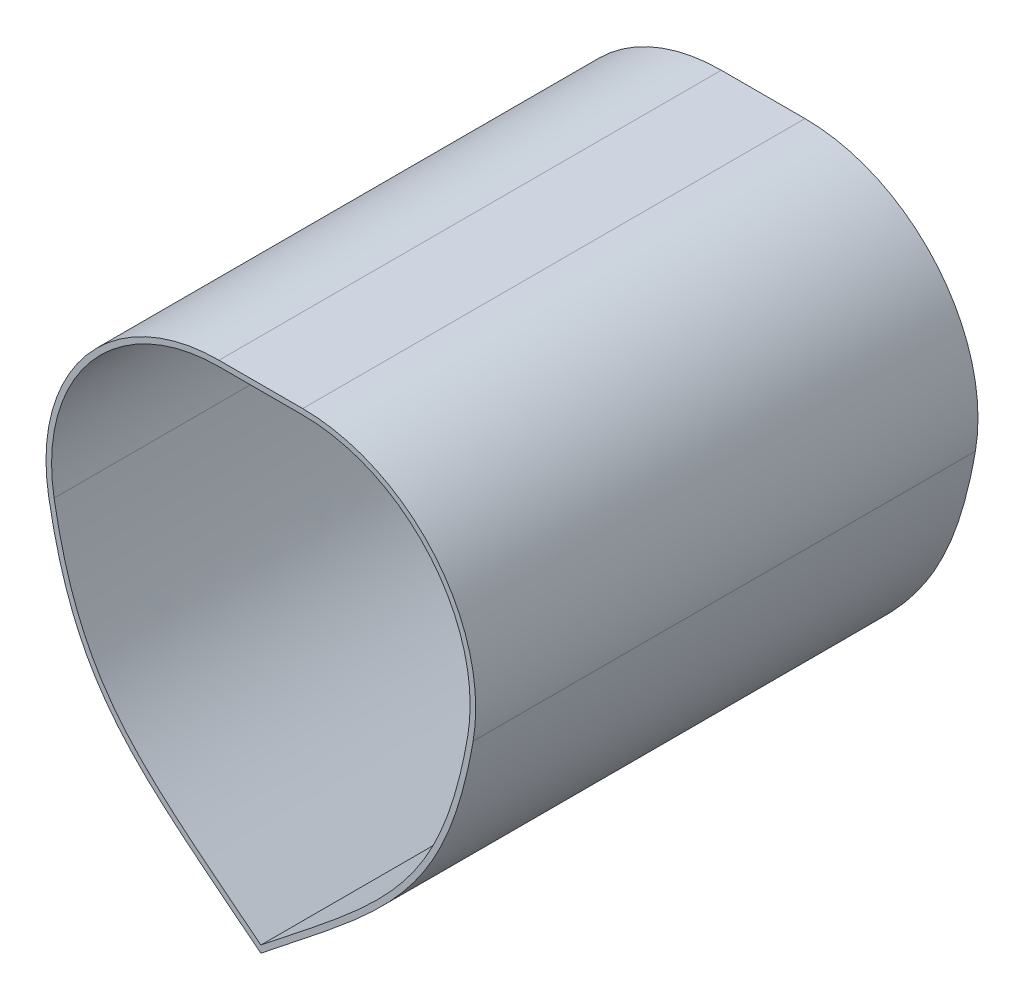
ISO-10303-21;
HEADER;
FILE_DESCRIPTION(('STEP AP214'),'2;1');
FILE_NAME('part.step','',(''),(''),'','','');
FILE_SCHEMA(('AUTOMOTIVE_DESIGN { 1 0 10303 214 1 1 1 1 }'));
ENDSEC;
DATA;
#1=APPLICATION_CONTEXT('core data for automotive mechanical design processes');
#2=APPLICATION_PROTOCOL_DEFINITION('international standard','automotive_design',2000,#1);
#3=PRODUCT_CONTEXT('',#1,'mechanical');
#4=PRODUCT('Part','Part','',(#3));
#5=PRODUCT_RELATED_PRODUCT_CATEGORY('part','',(#4));
#6=PRODUCT_DEFINITION_FORMATION('','',#4);
#7=PRODUCT_DEFINITION_CONTEXT('part definition',#1,'design');
#8=PRODUCT_DEFINITION('design','',#6,#7);
#9=PRODUCT_DEFINITION_SHAPE('','',#8);
#10=(LENGTH_UNIT() NAMED_UNIT(*) SI_UNIT(.MILLI.,.METRE.));
#11=(NAMED_UNIT(*) PLANE_ANGLE_UNIT() SI_UNIT($,.RADIAN.));
#12=(NAMED_UNIT(*) SI_UNIT($,.STERADIAN.) SOLID_ANGLE_UNIT());
#13=UNCERTAINTY_MEASURE_WITH_UNIT(LENGTH_MEASURE(1.E-05),#10,'distance_accuracy_value','');
#14=(GEOMETRIC_REPRESENTATION_CONTEXT(3) GLOBAL_UNCERTAINTY_ASSIGNED_CONTEXT((#13)) GLOBAL_UNIT_ASSIGNED_CONTEXT((#10,
#11,#12)) REPRESENTATION_CONTEXT('',''));
#15=CARTESIAN_POINT('',(0.,0.,0.));
#16=DIRECTION('',(0.,0.,1.));
#17=DIRECTION('',(1.,0.,0.));
#18=AXIS2_PLACEMENT_3D('',#15,#16,#17);
#19=CARTESIAN_POINT('',(7.50000000000002,-30.,90.));
#20=DIRECTION('',(0.,0.,-1.));
#21=DIRECTION('',(-1.,0.,0.));
#22=AXIS2_PLACEMENT_3D('',#19,#20,#21);
#23=PLANE('',#22);
#24=CARTESIAN_POINT('',(7.50000000000002,-30.,90.));
#25=DIRECTION('',(0.,0.,-1.));
#26=DIRECTION('',(-1.,0.,0.));
#27=AXIS2_PLACEMENT_3D('',#24,#25,#26);
#28=CIRCLE('',#27,31.00000000039);
#29=CARTESIAN_POINT('',(38.035382168266,-35.3470025141483,90.));
#30=VERTEX_POINT('',#29);
#31=CARTESIAN_POINT('',(7.50000000000001,1.,90.));
#32=VERTEX_POINT('',#31);
#33=EDGE_CURVE('E218',#30,#32,#28,.F.);
#34=ORIENTED_EDGE('',*,*,#33,.T.);
#35=DIRECTION('',(-1.,0.,0.));
#36=VECTOR('',#35,1.);
#37=CARTESIAN_POINT('',(7.50000000000001,1.,90.));
#38=LINE('',#37,#36);
#39=CARTESIAN_POINT('',(-7.49999999999999,1.,90.));
#40=VERTEX_POINT('',#39);
#41=EDGE_CURVE('E221',#32,#40,#38,.T.);
#42=ORIENTED_EDGE('',*,*,#41,.T.);
#43=CARTESIAN_POINT('',(-7.49999999999999,-30.,90.));
#44=DIRECTION('',(0.,0.,-1.));
#45=DIRECTION('',(-1.,0.,0.));
#46=AXIS2_PLACEMENT_3D('',#43,#44,#45);
#47=CIRCLE('',#46,31.0000000003738);
#48=CARTESIAN_POINT('',(-38.0353821678817,-35.3470025139877,90.));
#49=VERTEX_POINT('',#48);
#50=EDGE_CURVE('E224',#40,#49,#47,.F.);
#51=ORIENTED_EDGE('',*,*,#50,.T.);
#52=CARTESIAN_POINT('',(-38.0353821678817,-35.3470025139877,90.));
#53=CARTESIAN_POINT('',(-37.5548772752287,-38.091044711654,90.));
#54=CARTESIAN_POINT('',(-36.9822883935064,-40.8060836201717,90.));
#55=CARTESIAN_POINT('',(-35.5651587648619,-46.1505059539836,90.));
#56=CARTESIAN_POINT('',(-34.7201967506199,-48.7797566945623,90.));
#57=CARTESIAN_POINT('',(-33.1615785559713,-52.6319226413832,90.));
#58=CARTESIAN_POINT('',(-32.5933003750435,-53.9006269169014,90.));
#59=CARTESIAN_POINT('',(-31.6569648970911,-55.7772519816424,90.));
#60=CARTESIAN_POINT('',(-31.3302131469219,-56.39944948055,90.));
#61=CARTESIAN_POINT('',(-30.6546280964368,-57.6217528801752,90.));
#62=CARTESIAN_POINT('',(-30.3051339247036,-58.2232972999787,90.));
#63=CARTESIAN_POINT('',(-28.4997583725973,-61.1834785162522,90.));
#64=CARTESIAN_POINT('',(-26.8669707319669,-63.3968718224989,90.));
#65=CARTESIAN_POINT('',(-23.2936081412605,-67.570959050554,90.));
#66=CARTESIAN_POINT('',(-21.3552030997987,-69.5334345096587,90.));
#67=CARTESIAN_POINT('',(-18.3086312835862,-72.3630553352713,90.));
#68=CARTESIAN_POINT('',(-17.2691069456343,-73.2881893224012,90.));
#69=CARTESIAN_POINT('',(-15.1662054039002,-75.10550142771,90.));
#70=CARTESIAN_POINT('',(-14.1020486867199,-75.9985099712125,90.));
#71=CARTESIAN_POINT('',(-10.8861762356016,-78.6487154188085,90.));
#72=CARTESIAN_POINT('',(-8.71200864899408,-80.3782626255507,90.));
#73=CARTESIAN_POINT('',(-5.44481379026631,-82.9652639777595,90.));
#74=CARTESIAN_POINT('',(-4.35450638530162,-83.8260676687979,90.));
#75=CARTESIAN_POINT('',(-2.17547448835848,-85.5496244251936,90.));
#76=CARTESIAN_POINT('',(-1.0873039703784,-86.413059715471,90.));
#77=CARTESIAN_POINT('',(3.15560294908424E-11,-87.2775621683745,90.));
#78=B_SPLINE_CURVE_WITH_KNOTS('',3,(#52,#53,#54,#55,#56,#57,#58,#59,#60,#61,#62,#63,#64,#65,#66,
#67,#68,#69,#70,#71,#72,#73,#74,#75,#76,#77),.UNSPECIFIED.,.F.,.F.,(4,2,2,2,2,2,2,2,2,2,2,2,4),
(0.,0.124999999999999,0.249999999999998,0.312499999999998,0.343749999999998,0.374999999999998,
0.499999999999998,0.624999999999998,0.687499999999998,0.749999999999999,0.874999999999999,
0.9375,1.),.UNSPECIFIED.);
#79=CARTESIAN_POINT('',(3.15560294908424E-11,-87.2775621683745,90.));
#80=VERTEX_POINT('',#79);
#81=EDGE_CURVE('E226',#49,#80,#78,.T.);
#82=ORIENTED_EDGE('',*,*,#81,.T.);
#83=CARTESIAN_POINT('',(3.15560294908424E-11,-87.2775621683745,90.));
#84=CARTESIAN_POINT('',(1.08825791955665,-86.4123012417895,90.));
#85=CARTESIAN_POINT('',(2.17738223048351,-85.5481128518911,90.));
#86=CARTESIAN_POINT('',(4.35831445155176,-83.8230581948711,90.));
#87=CARTESIAN_POINT('',(5.4495695085125,-82.9615075311625,90.));
#88=CARTESIAN_POINT('',(8.71960050233189,-80.3722328696294,90.));
#89=CARTESIAN_POINT('',(10.8956515546259,-78.6411356404269,90.));
#90=CARTESIAN_POINT('',(15.1872123098211,-75.1039948954555,90.));
#91=CARTESIAN_POINT('',(17.30707074459,-73.2939756822945,90.));
#92=CARTESIAN_POINT('',(21.3670549034604,-69.5217398880481,90.));
#93=CARTESIAN_POINT('',(23.306811773598,-67.5574481489507,90.));
#94=CARTESIAN_POINT('',(26.8879810373477,-63.3703986668161,90.));
#95=CARTESIAN_POINT('',(28.5271989207947,-61.1457397447137,90.));
#96=CARTESIAN_POINT('',(30.3415709452379,-58.1616305015838,90.));
#97=CARTESIAN_POINT('',(30.6938032169842,-57.5530990711434,90.));
#98=CARTESIAN_POINT('',(31.3685903924633,-56.3275207608773,90.));
#99=CARTESIAN_POINT('',(31.6915813409841,-55.7099493342935,90.));
#100=CARTESIAN_POINT('',(32.6195100620392,-53.84360670894,90.));
#101=CARTESIAN_POINT('',(33.1833569685782,-52.5811916444626,90.));
#102=CARTESIAN_POINT('',(34.731190274976,-48.7462296507229,90.));
#103=CARTESIAN_POINT('',(35.5722237295399,-46.1262164356844,90.));
#104=CARTESIAN_POINT('',(36.9841990313474,-40.7965084296707,90.));
#105=CARTESIAN_POINT('',(37.5555919456647,-38.0869634116056,90.));
#106=CARTESIAN_POINT('',(38.035382168266,-35.3470025141483,90.));
#107=B_SPLINE_CURVE_WITH_KNOTS('',3,(#83,#84,#85,#86,#87,#88,#89,#90,#91,#92,#93,#94,#95,#96,
#97,#98,#99,#100,#101,#102,#103,#104,#105,#106),.UNSPECIFIED.,.F.,.F.,(4,2,2,2,2,2,2,2,2,2,2,4),
(0.,0.0625,0.125,0.25,0.375,0.5,0.625,0.65625,0.6875,0.75,0.875,1.),.UNSPECIFIED.);
#108=EDGE_CURVE('E231',#80,#30,#107,.T.);
#109=ORIENTED_EDGE('',*,*,#108,.T.);
#110=EDGE_LOOP('',(#34,#42,#51,#82,#109));
#111=FACE_BOUND('',#110,.T.);
#112=CARTESIAN_POINT('',(7.50000000000002,-30.,90.));
#113=DIRECTION('',(0.,0.,1.));
#114=DIRECTION('',(-1.,0.,0.));
#115=AXIS2_PLACEMENT_3D('',#112,#113,#114);
#116=CIRCLE('',#115,30.00000000039);
#117=CARTESIAN_POINT('',(37.0503698402829,-35.1745185620793,90.));
#118=VERTEX_POINT('',#117);
#119=CARTESIAN_POINT('',(7.50000000000001,0.,90.));
#120=VERTEX_POINT('',#119);
#121=EDGE_CURVE('E315',#118,#120,#116,.T.);
#122=ORIENTED_EDGE('',*,*,#121,.F.);
#123=CARTESIAN_POINT('',(0.,-86.,90.));
#124=CARTESIAN_POINT('',(21.8092003730451,-68.6597642118767,90.));
#125=CARTESIAN_POINT('',(32.3822384633183,-61.8330389623684,90.));
#126=CARTESIAN_POINT('',(37.0503698402829,-35.1745185620793,90.));
#127=B_SPLINE_CURVE_WITH_KNOTS('',3,(#123,#124,#125,#126),.UNSPECIFIED.,.F.,.F.,(4,4),
(0.0665187431228753,1.),.UNSPECIFIED.);
#128=CARTESIAN_POINT('',(0.,-86.,90.));
#129=VERTEX_POINT('',#128);
#130=EDGE_CURVE('E288',#129,#118,#127,.T.);
#131=ORIENTED_EDGE('',*,*,#130,.F.);
#132=CARTESIAN_POINT('',(-37.0503698402656,-35.1745185619901,90.));
#133=CARTESIAN_POINT('',(-32.3822384632756,-61.8330389612005,90.));
#134=CARTESIAN_POINT('',(-21.8092003731937,-68.6597642135159,90.));
#135=CARTESIAN_POINT('',(0.,-86.,90.));
#136=B_SPLINE_CURVE_WITH_KNOTS('',3,(#132,#133,#134,#135),.UNSPECIFIED.,.F.,.F.,(4,4),
(0.0665187431228752,1.),.UNSPECIFIED.);
#137=CARTESIAN_POINT('',(-37.0503698398973,-35.1745185619256,90.));
#138=VERTEX_POINT('',#137);
#139=EDGE_CURVE('E283',#138,#129,#136,.T.);
#140=ORIENTED_EDGE('',*,*,#139,.F.);
#141=CARTESIAN_POINT('',(-7.49999999999999,-30.,90.));
#142=DIRECTION('',(0.,0.,1.));
#143=DIRECTION('',(1.,0.,0.));
#144=AXIS2_PLACEMENT_3D('',#141,#142,#143);
#145=CIRCLE('',#144,30.0000000003738);
#146=CARTESIAN_POINT('',(-7.49999999999999,0.,90.));
#147=VERTEX_POINT('',#146);
#148=EDGE_CURVE('E289',#147,#138,#145,.T.);
#149=ORIENTED_EDGE('',*,*,#148,.F.);
#150=DIRECTION('',(-1.,0.,0.));
#151=VECTOR('',#150,1.);
#152=CARTESIAN_POINT('',(-7.49999999999999,0.,90.));
#153=LINE('',#152,#151);
#154=EDGE_CURVE('E210',#120,#147,#153,.T.);
#155=ORIENTED_EDGE('',*,*,#154,.F.);
#156=EDGE_LOOP('',(#122,#131,#140,#149,#155));
#157=FACE_BOUND('',#156,.T.);
#158=ADVANCED_FACE('F84',(#111,#157),#23,.F.);
#159=CARTESIAN_POINT('',(7.50000000000002,-30.,0.));
#160=DIRECTION('',(0.,0.,-1.));
#161=DIRECTION('',(-1.,0.,0.));
#162=AXIS2_PLACEMENT_3D('',#159,#160,#161);
#163=PLANE('',#162);
#164=CARTESIAN_POINT('',(-37.0503698402656,-35.1745185619901,0.));
#165=CARTESIAN_POINT('',(-32.3822384632756,-61.8330389612005,0.));
#166=CARTESIAN_POINT('',(-21.8092003731937,-68.6597642135159,0.));
#167=CARTESIAN_POINT('',(0.,-86.,0.));
#168=B_SPLINE_CURVE_WITH_KNOTS('',3,(#164,#165,#166,#167),.UNSPECIFIED.,.F.,.F.,(4,4),
(0.0665187431228752,1.),.UNSPECIFIED.);
#169=CARTESIAN_POINT('',(-30.1117047794454,-56.5368166917763,0.));
#170=VERTEX_POINT('',#169);
#171=CARTESIAN_POINT('',(-9.76662647386243,-78.2477775729952,0.));
#172=VERTEX_POINT('',#171);
#173=EDGE_CURVE('E299',#170,#172,#168,.T.);
#174=ORIENTED_EDGE('',*,*,#173,.T.);
#175=CARTESIAN_POINT('',(0.,-86.,0.));
#176=CARTESIAN_POINT('',(-20.563045317963,-69.8933500667428,0.));
#177=CARTESIAN_POINT('',(-35.4605614493091,-58.3783764105945,0.));
#178=CARTESIAN_POINT('',(-37.4163785796124,-32.238368307788,0.));
#179=B_SPLINE_CURVE_WITH_KNOTS('',3,(#175,#176,#177,#178),.UNSPECIFIED.,.F.,.F.,(4,4),
(0.0665187431228753,1.),.UNSPECIFIED.);
#180=EDGE_CURVE('E206',#172,#170,#179,.T.);
#181=ORIENTED_EDGE('',*,*,#180,.T.);
#182=EDGE_LOOP('',(#174,#181));
#183=FACE_BOUND('',#182,.T.);
#184=CARTESIAN_POINT('',(0.,-86.,0.));
#185=CARTESIAN_POINT('',(21.8092003730451,-68.6597642118767,0.));
#186=CARTESIAN_POINT('',(32.3822384633183,-61.8330389623684,0.));
#187=CARTESIAN_POINT('',(37.0503698402829,-35.1745185620793,0.));
#188=B_SPLINE_CURVE_WITH_KNOTS('',3,(#184,#185,#186,#187),.UNSPECIFIED.,.F.,.F.,(4,4),
(0.0665187431228753,1.),.UNSPECIFIED.);
#189=CARTESIAN_POINT('',(9.76662689713622,-78.2477772268258,0.));
#190=VERTEX_POINT('',#189);
#191=CARTESIAN_POINT('',(30.1117047806334,-56.5368166897852,0.));
#192=VERTEX_POINT('',#191);
#193=EDGE_CURVE('E307',#190,#192,#188,.T.);
#194=ORIENTED_EDGE('',*,*,#193,.T.);
#195=CARTESIAN_POINT('',(37.4163785796124,-32.238368307788,0.));
#196=CARTESIAN_POINT('',(35.4605614493091,-58.3783764105942,0.));
#197=CARTESIAN_POINT('',(20.5630453179632,-69.8933500667434,0.));
#198=CARTESIAN_POINT('',(0.,-86.,0.));
#199=B_SPLINE_CURVE_WITH_KNOTS('',3,(#195,#196,#197,#198),.UNSPECIFIED.,.F.,.F.,(4,4),
(0.0665187431228752,1.),.UNSPECIFIED.);
#200=EDGE_CURVE('E100',#192,#190,#199,.T.);
#201=ORIENTED_EDGE('',*,*,#200,.T.);
#202=EDGE_LOOP('',(#194,#201));
#203=FACE_BOUND('',#202,.T.);
#204=CARTESIAN_POINT('',(7.50000000000002,-30.,0.));
#205=DIRECTION('',(0.,0.,-1.));
#206=DIRECTION('',(-1.,0.,0.));
#207=AXIS2_PLACEMENT_3D('',#204,#205,#206);
#208=CIRCLE('',#207,31.00000000039);
#209=CARTESIAN_POINT('',(38.035382168266,-35.3470025141483,0.));
#210=VERTEX_POINT('',#209);
#211=CARTESIAN_POINT('',(7.50000000000001,1.,0.));
#212=VERTEX_POINT('',#211);
#213=EDGE_CURVE('E213',#210,#212,#208,.F.);
#214=ORIENTED_EDGE('',*,*,#213,.F.);
#215=CARTESIAN_POINT('',(3.15560294908424E-11,-87.2775621683745,0.));
#216=CARTESIAN_POINT('',(1.08825791955665,-86.4123012417895,0.));
#217=CARTESIAN_POINT('',(2.17738223048351,-85.5481128518911,0.));
#218=CARTESIAN_POINT('',(4.35831445155176,-83.8230581948711,0.));
#219=CARTESIAN_POINT('',(5.4495695085125,-82.9615075311625,0.));
#220=CARTESIAN_POINT('',(8.71960050233189,-80.3722328696294,0.));
#221=CARTESIAN_POINT('',(10.8956515546259,-78.6411356404269,0.));
#222=CARTESIAN_POINT('',(15.1872123098211,-75.1039948954555,0.));
#223=CARTESIAN_POINT('',(17.30707074459,-73.2939756822945,0.));
#224=CARTESIAN_POINT('',(21.3670549034604,-69.5217398880481,0.));
#225=CARTESIAN_POINT('',(23.306811773598,-67.5574481489507,0.));
#226=CARTESIAN_POINT('',(26.8879810373477,-63.3703986668161,0.));
#227=CARTESIAN_POINT('',(28.5271989207947,-61.1457397447137,0.));
#228=CARTESIAN_POINT('',(30.3415709452379,-58.1616305015838,0.));
#229=CARTESIAN_POINT('',(30.6938032169842,-57.5530990711434,0.));
#230=CARTESIAN_POINT('',(31.3685903924633,-56.3275207608773,0.));
#231=CARTESIAN_POINT('',(31.6915813409841,-55.7099493342935,0.));
#232=CARTESIAN_POINT('',(32.6195100620392,-53.84360670894,0.));
#233=CARTESIAN_POINT('',(33.1833569685782,-52.5811916444626,0.));
#234=CARTESIAN_POINT('',(34.731190274976,-48.7462296507229,0.));
#235=CARTESIAN_POINT('',(35.5722237295399,-46.1262164356844,0.));
#236=CARTESIAN_POINT('',(36.9841990313474,-40.7965084296707,0.));
#237=CARTESIAN_POINT('',(37.5555919456647,-38.0869634116056,0.));
#238=CARTESIAN_POINT('',(38.035382168266,-35.3470025141483,0.));
#239=B_SPLINE_CURVE_WITH_KNOTS('',3,(#215,#216,#217,#218,#219,#220,#221,#222,#223,#224,#225,
#226,#227,#228,#229,#230,#231,#232,#233,#234,#235,#236,#237,#238),.UNSPECIFIED.,.F.,.F.,(4,2,2,
2,2,2,2,2,2,2,2,4),(0.,0.0625,0.125,0.25,0.375,0.5,0.625,0.65625,0.6875,0.75,0.875,1.),.UNSPECIFIED.);
#240=CARTESIAN_POINT('',(3.15560294908424E-11,-87.2775621683745,0.));
#241=VERTEX_POINT('',#240);
#242=EDGE_CURVE('E222',#241,#210,#239,.T.);
#243=ORIENTED_EDGE('',*,*,#242,.F.);
#244=CARTESIAN_POINT('',(-38.0353821678817,-35.3470025139877,0.));
#245=CARTESIAN_POINT('',(-37.5548772752287,-38.091044711654,0.));
#246=CARTESIAN_POINT('',(-36.9822883935064,-40.8060836201717,0.));
#247=CARTESIAN_POINT('',(-35.5651587648619,-46.1505059539836,0.));
#248=CARTESIAN_POINT('',(-34.7201967506199,-48.7797566945623,0.));
#249=CARTESIAN_POINT('',(-33.1615785559713,-52.6319226413832,0.));
#250=CARTESIAN_POINT('',(-32.5933003750435,-53.9006269169014,0.));
#251=CARTESIAN_POINT('',(-31.6569648970911,-55.7772519816424,0.));
#252=CARTESIAN_POINT('',(-31.3302131469219,-56.39944948055,0.));
#253=CARTESIAN_POINT('',(-30.6546280964368,-57.6217528801752,0.));
#254=CARTESIAN_POINT('',(-30.3051339247036,-58.2232972999787,0.));
#255=CARTESIAN_POINT('',(-28.4997583725973,-61.1834785162522,0.));
#256=CARTESIAN_POINT('',(-26.8669707319669,-63.3968718224989,0.));
#257=CARTESIAN_POINT('',(-23.2936081412605,-67.570959050554,0.));
#258=CARTESIAN_POINT('',(-21.3552030997987,-69.5334345096587,0.));
#259=CARTESIAN_POINT('',(-18.3086312835862,-72.3630553352713,0.));
#260=CARTESIAN_POINT('',(-17.2691069456343,-73.2881893224012,0.));
#261=CARTESIAN_POINT('',(-15.1662054039002,-75.10550142771,0.));
#262=CARTESIAN_POINT('',(-14.1020486867199,-75.9985099712125,0.));
#263=CARTESIAN_POINT('',(-10.8861762356016,-78.6487154188085,0.));
#264=CARTESIAN_POINT('',(-8.71200864899408,-80.3782626255507,0.));
#265=CARTESIAN_POINT('',(-5.44481379026631,-82.9652639777595,0.));
#266=CARTESIAN_POINT('',(-4.35450638530162,-83.8260676687979,0.));
#267=CARTESIAN_POINT('',(-2.17547448835848,-85.5496244251936,0.));
#268=CARTESIAN_POINT('',(-1.0873039703784,-86.413059715471,0.));
#269=CARTESIAN_POINT('',(3.15560294908424E-11,-87.2775621683745,0.));
#270=B_SPLINE_CURVE_WITH_KNOTS('',3,(#244,#245,#246,#247,#248,#249,#250,#251,#252,#253,#254,
#255,#256,#257,#258,#259,#260,#261,#262,#263,#264,#265,#266,#267,#268,#269),.UNSPECIFIED.,.F.,
.F.,(4,2,2,2,2,2,2,2,2,2,2,2,4),(0.,0.124999999999999,0.249999999999998,0.312499999999998,
0.343749999999998,0.374999999999998,0.499999999999998,0.624999999999998,0.687499999999998,
0.749999999999999,0.874999999999999,0.9375,1.),.UNSPECIFIED.);
#271=CARTESIAN_POINT('',(-38.0353821678817,-35.3470025139877,0.));
#272=VERTEX_POINT('',#271);
#273=EDGE_CURVE('E498',#272,#241,#270,.T.);
#274=ORIENTED_EDGE('',*,*,#273,.F.);
#275=CARTESIAN_POINT('',(-7.49999999999999,-30.,0.));
#276=DIRECTION('',(0.,0.,-1.));
#277=DIRECTION('',(-1.,0.,0.));
#278=AXIS2_PLACEMENT_3D('',#275,#276,#277);
#279=CIRCLE('',#278,31.0000000003738);
#280=CARTESIAN_POINT('',(-7.49999999999999,1.,0.));
#281=VERTEX_POINT('',#280);
#282=EDGE_CURVE('E506',#281,#272,#279,.F.);
#283=ORIENTED_EDGE('',*,*,#282,.F.);
#284=DIRECTION('',(-1.,0.,0.));
#285=VECTOR('',#284,1.);
#286=CARTESIAN_POINT('',(7.50000000000001,1.,0.));
#287=LINE('',#286,#285);
#288=EDGE_CURVE('E504',#212,#281,#287,.T.);
#289=ORIENTED_EDGE('',*,*,#288,.F.);
#290=EDGE_LOOP('',(#214,#243,#274,#283,#289));
#291=FACE_BOUND('',#290,.T.);
#292=ADVANCED_FACE('F256',(#183,#203,#291),#163,.T.);
#293=CARTESIAN_POINT('',(7.50000000000002,-30.,90.));
#294=DIRECTION('',(0.,0.,-1.));
#295=DIRECTION('',(-1.,0.,0.));
#296=AXIS2_PLACEMENT_3D('',#293,#294,#295);
#297=CYLINDRICAL_SURFACE('',#296,31.00000000039);
#298=ORIENTED_EDGE('',*,*,#213,.T.);
#299=DIRECTION('',(0.,0.,-1.));
#300=VECTOR('',#299,1.);
#301=CARTESIAN_POINT('',(7.50000000000001,1.,90.));
#302=LINE('',#301,#300);
#303=EDGE_CURVE('E324',#32,#212,#302,.T.);
#304=ORIENTED_EDGE('',*,*,#303,.F.);
#305=ORIENTED_EDGE('',*,*,#33,.F.);
#306=DIRECTION('',(0.,0.,-1.));
#307=VECTOR('',#306,1.);
#308=CARTESIAN_POINT('',(38.035382168266,-35.3470025141483,90.));
#309=LINE('',#308,#307);
#310=EDGE_CURVE('E491',#30,#210,#309,.T.);
#311=ORIENTED_EDGE('',*,*,#310,.T.);
#312=EDGE_LOOP('',(#298,#304,#305,#311));
#313=FACE_BOUND('',#312,.T.);
#314=ADVANCED_FACE('F86',(#313),#297,.T.);
#315=CARTESIAN_POINT('',(7.50000000000001,1.,90.));
#316=DIRECTION('',(0.,-1.,0.));
#317=DIRECTION('',(1.,0.,0.));
#318=AXIS2_PLACEMENT_3D('',#315,#316,#317);
#319=PLANE('',#318);
#320=ORIENTED_EDGE('',*,*,#288,.T.);
#321=DIRECTION('',(0.,0.,-1.));
#322=VECTOR('',#321,1.);
#323=CARTESIAN_POINT('',(-7.49999999999999,1.,90.));
#324=LINE('',#323,#322);
#325=EDGE_CURVE('E524',#40,#281,#324,.T.);
#326=ORIENTED_EDGE('',*,*,#325,.F.);
#327=ORIENTED_EDGE('',*,*,#41,.F.);
#328=ORIENTED_EDGE('',*,*,#303,.T.);
#329=EDGE_LOOP('',(#320,#326,#327,#328));
#330=FACE_BOUND('',#329,.T.);
#331=ADVANCED_FACE('F249',(#330),#319,.F.);
#332=CARTESIAN_POINT('',(-7.49999999999999,-30.,90.));
#333=DIRECTION('',(0.,0.,-1.));
#334=DIRECTION('',(-1.,0.,0.));
#335=AXIS2_PLACEMENT_3D('',#332,#333,#334);
#336=CYLINDRICAL_SURFACE('',#335,31.0000000003738);
#337=ORIENTED_EDGE('',*,*,#282,.T.);
#338=DIRECTION('',(0.,0.,-1.));
#339=VECTOR('',#338,1.);
#340=CARTESIAN_POINT('',(-38.0353821678817,-35.3470025139877,90.));
#341=LINE('',#340,#339);
#342=EDGE_CURVE('E522',#49,#272,#341,.T.);
#343=ORIENTED_EDGE('',*,*,#342,.F.);
#344=ORIENTED_EDGE('',*,*,#50,.F.);
#345=ORIENTED_EDGE('',*,*,#325,.T.);
#346=EDGE_LOOP('',(#337,#343,#344,#345));
#347=FACE_BOUND('',#346,.T.);
#348=ADVANCED_FACE('F245',(#347),#336,.T.);
#349=DIRECTION('',(0.,0.,-1.));
#350=VECTOR('',#349,1.);
#351=SURFACE_OF_LINEAR_EXTRUSION('',#78,#350);
#352=ORIENTED_EDGE('',*,*,#273,.T.);
#353=DIRECTION('',(0.,0.,-1.));
#354=VECTOR('',#353,1.);
#355=CARTESIAN_POINT('',(3.15560294908424E-11,-87.2775621683745,90.));
#356=LINE('',#355,#354);
#357=EDGE_CURVE('E494',#80,#241,#356,.T.);
#358=ORIENTED_EDGE('',*,*,#357,.F.);
#359=ORIENTED_EDGE('',*,*,#81,.F.);
#360=ORIENTED_EDGE('',*,*,#342,.T.);
#361=EDGE_LOOP('',(#352,#358,#359,#360));
#362=FACE_BOUND('',#361,.T.);
#363=ADVANCED_FACE('F240',(#362),#351,.F.);
#364=DIRECTION('',(0.,0.,-1.));
#365=VECTOR('',#364,1.);
#366=SURFACE_OF_LINEAR_EXTRUSION('',#107,#365);
#367=ORIENTED_EDGE('',*,*,#242,.T.);
#368=ORIENTED_EDGE('',*,*,#310,.F.);
#369=ORIENTED_EDGE('',*,*,#108,.F.);
#370=ORIENTED_EDGE('',*,*,#357,.T.);
#371=EDGE_LOOP('',(#367,#368,#369,#370));
#372=FACE_BOUND('',#371,.T.);
#373=ADVANCED_FACE('F244',(#372),#366,.F.);
#374=CARTESIAN_POINT('',(7.50000000000002,-30.,90.));
#375=DIRECTION('',(0.,0.,-1.));
#376=DIRECTION('',(-1.,0.,0.));
#377=AXIS2_PLACEMENT_3D('',#374,#375,#376);
#378=CYLINDRICAL_SURFACE('',#377,30.00000000039);
#379=CARTESIAN_POINT('',(7.5,-30.,1.));
#380=DIRECTION('',(0.,0.,-1.));
#381=DIRECTION('',(-1.,0.,0.));
#382=AXIS2_PLACEMENT_3D('',#379,#380,#381);
#383=CIRCLE('',#382,30.);
#384=CARTESIAN_POINT('',(7.5,0.,1.));
#385=VERTEX_POINT('',#384);
#386=CARTESIAN_POINT('',(37.0503698402829,-35.1745185620793,1.00000000000003));
#387=VERTEX_POINT('',#386);
#388=EDGE_CURVE('E192',#385,#387,#383,.T.);
#389=ORIENTED_EDGE('',*,*,#388,.T.);
#390=DIRECTION('',(0.,0.,-1.));
#391=VECTOR('',#390,1.);
#392=CARTESIAN_POINT('',(37.0503698402829,-35.1745185620793,90.));
#393=LINE('',#392,#391);
#394=EDGE_CURVE('E298',#118,#387,#393,.T.);
#395=ORIENTED_EDGE('',*,*,#394,.F.);
#396=ORIENTED_EDGE('',*,*,#121,.T.);
#397=DIRECTION('',(0.,0.,-1.));
#398=VECTOR('',#397,1.);
#399=CARTESIAN_POINT('',(7.50000000000001,0.,90.));
#400=LINE('',#399,#398);
#401=EDGE_CURVE('E211',#120,#385,#400,.T.);
#402=ORIENTED_EDGE('',*,*,#401,.T.);
#403=EDGE_LOOP('',(#389,#395,#396,#402));
#404=FACE_BOUND('',#403,.T.);
#405=ADVANCED_FACE('F267',(#404),#378,.F.);
#406=CARTESIAN_POINT('',(-7.49999999999999,0.,90.));
#407=DIRECTION('',(0.,-1.,0.));
#408=DIRECTION('',(1.,0.,0.));
#409=AXIS2_PLACEMENT_3D('',#406,#407,#408);
#410=PLANE('',#409);
#411=DIRECTION('',(1.,0.,0.));
#412=VECTOR('',#411,1.);
#413=CARTESIAN_POINT('',(7.5,0.,1.));
#414=LINE('',#413,#412);
#415=CARTESIAN_POINT('',(-7.5,0.,1.));
#416=VERTEX_POINT('',#415);
#417=EDGE_CURVE('E186',#416,#385,#414,.T.);
#418=ORIENTED_EDGE('',*,*,#417,.T.);
#419=ORIENTED_EDGE('',*,*,#401,.F.);
#420=ORIENTED_EDGE('',*,*,#154,.T.);
#421=DIRECTION('',(0.,0.,-1.));
#422=VECTOR('',#421,1.);
#423=CARTESIAN_POINT('',(-7.49999999999999,0.,90.));
#424=LINE('',#423,#422);
#425=EDGE_CURVE('E202',#147,#416,#424,.T.);
#426=ORIENTED_EDGE('',*,*,#425,.T.);
#427=EDGE_LOOP('',(#418,#419,#420,#426));
#428=FACE_BOUND('',#427,.T.);
#429=ADVANCED_FACE('F208',(#428),#410,.T.);
#430=CARTESIAN_POINT('',(-7.49999999999999,-30.,90.));
#431=DIRECTION('',(0.,0.,-1.));
#432=DIRECTION('',(-1.,0.,0.));
#433=AXIS2_PLACEMENT_3D('',#430,#431,#432);
#434=CYLINDRICAL_SURFACE('',#433,30.0000000003738);
#435=CARTESIAN_POINT('',(-7.5,-30.,1.));
#436=DIRECTION('',(0.,0.,-1.));
#437=DIRECTION('',(1.,0.,0.));
#438=AXIS2_PLACEMENT_3D('',#435,#436,#437);
#439=CIRCLE('',#438,30.);
#440=CARTESIAN_POINT('',(-37.0503698402656,-35.1745185619901,1.00000000000003));
#441=VERTEX_POINT('',#440);
#442=EDGE_CURVE('E189',#441,#416,#439,.T.);
#443=ORIENTED_EDGE('',*,*,#442,.T.);
#444=ORIENTED_EDGE('',*,*,#425,.F.);
#445=ORIENTED_EDGE('',*,*,#148,.T.);
#446=DIRECTION('',(0.,0.,-1.));
#447=VECTOR('',#446,1.);
#448=CARTESIAN_POINT('',(-37.0503698398973,-35.1745185619256,90.));
#449=LINE('',#448,#447);
#450=EDGE_CURVE('E205',#138,#441,#449,.T.);
#451=ORIENTED_EDGE('',*,*,#450,.T.);
#452=EDGE_LOOP('',(#443,#444,#445,#451));
#453=FACE_BOUND('',#452,.T.);
#454=ADVANCED_FACE('F201',(#453),#434,.F.);
#455=DIRECTION('',(0.,0.,-1.));
#456=VECTOR('',#455,1.);
#457=SURFACE_OF_LINEAR_EXTRUSION('',#136,#456);
#458=DIRECTION('',(0.,0.,-1.));
#459=VECTOR('',#458,1.);
#460=CARTESIAN_POINT('',(-30.1117047386633,-56.5368167601245,1.));
#461=LINE('',#460,#459);
#462=CARTESIAN_POINT('',(-30.1117047794454,-56.5368166917763,1.));
#463=VERTEX_POINT('',#462);
#464=EDGE_CURVE('E354',#463,#170,#461,.T.);
#465=ORIENTED_EDGE('',*,*,#464,.F.);
#466=CARTESIAN_POINT('',(-37.0503698402656,-35.1745185619901,1.00000000000003));
#467=CARTESIAN_POINT('',(-32.3822384632756,-61.8330389612005,1.00000000000003));
#468=CARTESIAN_POINT('',(-21.8092003731937,-68.6597642135159,1.00000000000003));
#469=CARTESIAN_POINT('',(0.,-86.,1.00000000000003));
#470=B_SPLINE_CURVE_WITH_KNOTS('',3,(#466,#467,#468,#469),.UNSPECIFIED.,.F.,.F.,(4,4),
(0.0665187431228752,1.),.UNSPECIFIED.);
#471=EDGE_CURVE('E355',#441,#463,#470,.T.);
#472=ORIENTED_EDGE('',*,*,#471,.F.);
#473=ORIENTED_EDGE('',*,*,#450,.F.);
#474=ORIENTED_EDGE('',*,*,#139,.T.);
#475=DIRECTION('',(0.,0.,-1.));
#476=VECTOR('',#475,1.);
#477=CARTESIAN_POINT('',(0.,-86.,90.));
#478=LINE('',#477,#476);
#479=CARTESIAN_POINT('',(0.,-86.,1.));
#480=VERTEX_POINT('',#479);
#481=EDGE_CURVE('E107',#129,#480,#478,.T.);
#482=ORIENTED_EDGE('',*,*,#481,.T.);
#483=CARTESIAN_POINT('',(-9.76662647386243,-78.2477775729952,1.));
#484=VERTEX_POINT('',#483);
#485=EDGE_CURVE('E88',#484,#480,#470,.T.);
#486=ORIENTED_EDGE('',*,*,#485,.F.);
#487=DIRECTION('',(0.,0.,-1.));
#488=VECTOR('',#487,1.);
#489=CARTESIAN_POINT('',(-9.76662685576711,-78.2477772606373,1.));
#490=LINE('',#489,#488);
#491=EDGE_CURVE('E308',#172,#484,#490,.F.);
#492=ORIENTED_EDGE('',*,*,#491,.F.);
#493=ORIENTED_EDGE('',*,*,#173,.F.);
#494=EDGE_LOOP('',(#465,#472,#473,#474,#482,#486,#492,#493));
#495=FACE_BOUND('',#494,.T.);
#496=ADVANCED_FACE('F275',(#495),#457,.T.);
#497=DIRECTION('',(0.,0.,-1.));
#498=VECTOR('',#497,1.);
#499=SURFACE_OF_LINEAR_EXTRUSION('',#127,#498);
#500=DIRECTION('',(0.,0.,-1.));
#501=VECTOR('',#500,1.);
#502=CARTESIAN_POINT('',(9.76662689532683,-78.2477772282818,1.));
#503=LINE('',#502,#501);
#504=CARTESIAN_POINT('',(9.76662651341923,-78.2477775406421,1.));
#505=VERTEX_POINT('',#504);
#506=EDGE_CURVE('E12',#505,#190,#503,.T.);
#507=ORIENTED_EDGE('',*,*,#506,.F.);
#508=CARTESIAN_POINT('',(0.,-86.,1.00000000000003));
#509=CARTESIAN_POINT('',(21.8092003730451,-68.6597642118767,1.00000000000003));
#510=CARTESIAN_POINT('',(32.3822384633183,-61.8330389623684,1.00000000000003));
#511=CARTESIAN_POINT('',(37.0503698402829,-35.1745185620793,1.00000000000003));
#512=B_SPLINE_CURVE_WITH_KNOTS('',3,(#508,#509,#510,#511),.UNSPECIFIED.,.F.,.F.,(4,4),
(0.0665187431228753,1.),.UNSPECIFIED.);
#513=EDGE_CURVE('E94',#480,#505,#512,.T.);
#514=ORIENTED_EDGE('',*,*,#513,.F.);
#515=ORIENTED_EDGE('',*,*,#481,.F.);
#516=ORIENTED_EDGE('',*,*,#130,.T.);
#517=ORIENTED_EDGE('',*,*,#394,.T.);
#518=CARTESIAN_POINT('',(30.1117047806334,-56.5368166897852,1.));
#519=VERTEX_POINT('',#518);
#520=EDGE_CURVE('E326',#519,#387,#512,.T.);
#521=ORIENTED_EDGE('',*,*,#520,.F.);
#522=DIRECTION('',(0.,0.,-1.));
#523=VECTOR('',#522,1.);
#524=CARTESIAN_POINT('',(30.1117047398516,-56.536816758133,1.));
#525=LINE('',#524,#523);
#526=EDGE_CURVE('E331',#192,#519,#525,.F.);
#527=ORIENTED_EDGE('',*,*,#526,.F.);
#528=ORIENTED_EDGE('',*,*,#193,.F.);
#529=EDGE_LOOP('',(#507,#514,#515,#516,#517,#521,#527,#528));
#530=FACE_BOUND('',#529,.T.);
#531=ADVANCED_FACE('F279',(#530),#499,.T.);
#532=CARTESIAN_POINT('',(0.,-86.,1.));
#533=CARTESIAN_POINT('',(-20.563045317963,-69.8933500667428,1.));
#534=CARTESIAN_POINT('',(-35.4605614493091,-58.3783764105945,1.));
#535=CARTESIAN_POINT('',(-37.4163785796124,-32.238368307788,1.));
#536=B_SPLINE_CURVE_WITH_KNOTS('',3,(#532,#533,#534,#535),.UNSPECIFIED.,.F.,.F.,(4,4),
(0.0665187431228753,1.),.UNSPECIFIED.);
#537=DIRECTION('',(0.,0.,-1.));
#538=VECTOR('',#537,1.);
#539=SURFACE_OF_LINEAR_EXTRUSION('',#536,#538);
#540=ORIENTED_EDGE('',*,*,#180,.F.);
#541=ORIENTED_EDGE('',*,*,#491,.T.);
#542=EDGE_CURVE('E345',#484,#463,#536,.T.);
#543=ORIENTED_EDGE('',*,*,#542,.T.);
#544=ORIENTED_EDGE('',*,*,#464,.T.);
#545=EDGE_LOOP('',(#540,#541,#543,#544));
#546=FACE_BOUND('',#545,.T.);
#547=ADVANCED_FACE('F388',(#546),#539,.T.);
#548=CARTESIAN_POINT('',(37.4163785796124,-32.238368307788,1.));
#549=CARTESIAN_POINT('',(35.4605614493091,-58.3783764105942,1.));
#550=CARTESIAN_POINT('',(20.5630453179632,-69.8933500667434,1.));
#551=CARTESIAN_POINT('',(0.,-86.,1.));
#552=B_SPLINE_CURVE_WITH_KNOTS('',3,(#548,#549,#550,#551),.UNSPECIFIED.,.F.,.F.,(4,4),
(0.0665187431228752,1.),.UNSPECIFIED.);
#553=DIRECTION('',(0.,0.,-1.));
#554=VECTOR('',#553,1.);
#555=SURFACE_OF_LINEAR_EXTRUSION('',#552,#554);
#556=ORIENTED_EDGE('',*,*,#200,.F.);
#557=ORIENTED_EDGE('',*,*,#526,.T.);
#558=EDGE_CURVE('E341',#519,#505,#552,.T.);
#559=ORIENTED_EDGE('',*,*,#558,.T.);
#560=ORIENTED_EDGE('',*,*,#506,.T.);
#561=EDGE_LOOP('',(#556,#557,#559,#560));
#562=FACE_BOUND('',#561,.T.);
#563=ADVANCED_FACE('F340',(#562),#555,.T.);
#564=CARTESIAN_POINT('',(-7.5,-30.,1.));
#565=DIRECTION('',(0.,0.,1.));
#566=DIRECTION('',(1.,0.,0.));
#567=AXIS2_PLACEMENT_3D('',#564,#565,#566);
#568=PLANE('',#567);
#569=ORIENTED_EDGE('',*,*,#442,.F.);
#570=ORIENTED_EDGE('',*,*,#471,.T.);
#571=ORIENTED_EDGE('',*,*,#542,.F.);
#572=ORIENTED_EDGE('',*,*,#485,.T.);
#573=ORIENTED_EDGE('',*,*,#513,.T.);
#574=ORIENTED_EDGE('',*,*,#558,.F.);
#575=ORIENTED_EDGE('',*,*,#520,.T.);
#576=ORIENTED_EDGE('',*,*,#388,.F.);
#577=ORIENTED_EDGE('',*,*,#417,.F.);
#578=EDGE_LOOP('',(#569,#570,#571,#572,#573,#574,#575,#576,#577));
#579=FACE_BOUND('',#578,.T.);
#580=ADVANCED_FACE('F188',(#579),#568,.T.);
#581=CLOSED_SHELL('',(#158,#292,#314,#331,#348,#363,#373,#405,#429,#454,#496,#531,#547,#563,#580));
#582=MANIFOLD_SOLID_BREP('B2',#581);
#583=ADVANCED_BREP_SHAPE_REPRESENTATION('',(#18,#582),#14);
#584=SHAPE_DEFINITION_REPRESENTATION(#9,#583);
ENDSEC;
END-ISO-10303-21;
